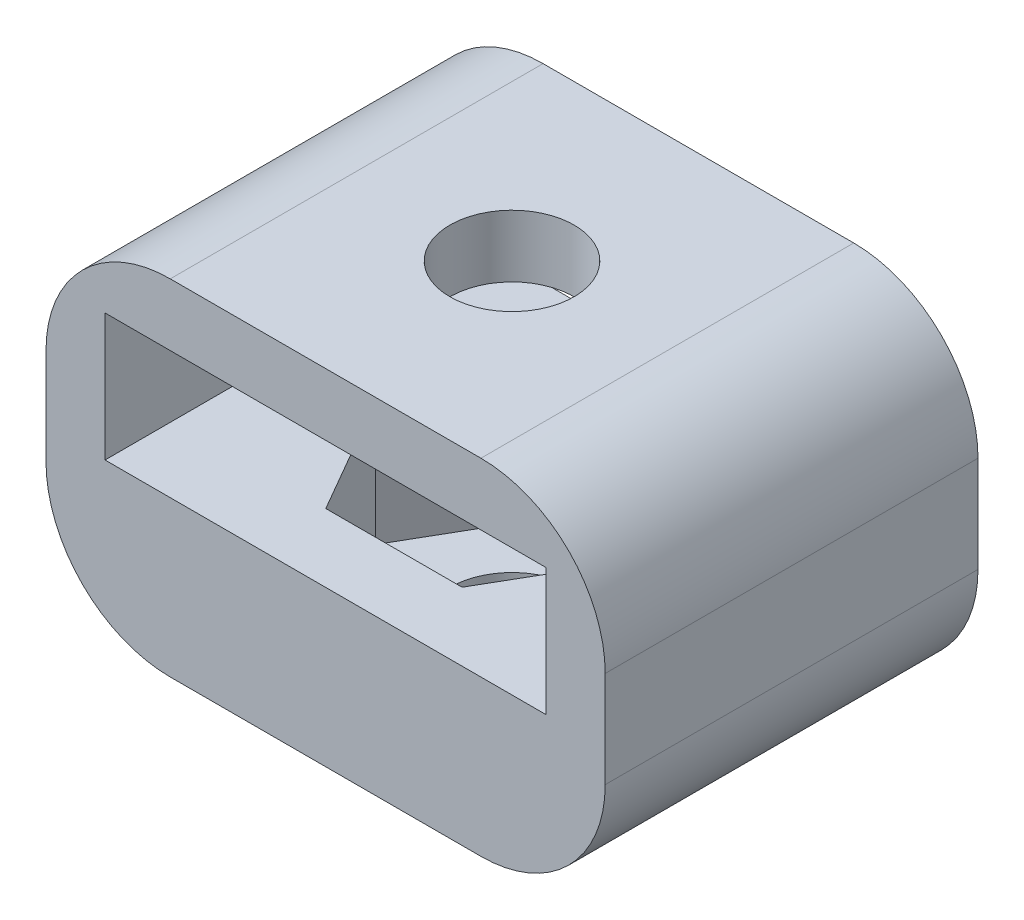
ISO-10303-21;
HEADER;
FILE_DESCRIPTION(('STEP AP214'),'2;1');
FILE_NAME('part.step','',(''),(''),'','','');
FILE_SCHEMA(('AUTOMOTIVE_DESIGN { 1 0 10303 214 1 1 1 1 }'));
ENDSEC;
DATA;
#1=APPLICATION_CONTEXT('core data for automotive mechanical design processes');
#2=APPLICATION_PROTOCOL_DEFINITION('international standard','automotive_design',2000,#1);
#3=PRODUCT_CONTEXT('',#1,'mechanical');
#4=PRODUCT('Part','Part','',(#3));
#5=PRODUCT_RELATED_PRODUCT_CATEGORY('part','',(#4));
#6=PRODUCT_DEFINITION_FORMATION('','',#4);
#7=PRODUCT_DEFINITION_CONTEXT('part definition',#1,'design');
#8=PRODUCT_DEFINITION('design','',#6,#7);
#9=PRODUCT_DEFINITION_SHAPE('','',#8);
#10=(LENGTH_UNIT() NAMED_UNIT(*) SI_UNIT(.MILLI.,.METRE.));
#11=(NAMED_UNIT(*) PLANE_ANGLE_UNIT() SI_UNIT($,.RADIAN.));
#12=(NAMED_UNIT(*) SI_UNIT($,.STERADIAN.) SOLID_ANGLE_UNIT());
#13=UNCERTAINTY_MEASURE_WITH_UNIT(LENGTH_MEASURE(1.E-05),#10,'distance_accuracy_value','');
#14=(GEOMETRIC_REPRESENTATION_CONTEXT(3) GLOBAL_UNCERTAINTY_ASSIGNED_CONTEXT((#13)) GLOBAL_UNIT_ASSIGNED_CONTEXT((#10,
#11,#12)) REPRESENTATION_CONTEXT('',''));
#15=CARTESIAN_POINT('',(0.,0.,0.));
#16=DIRECTION('',(0.,0.,1.));
#17=DIRECTION('',(1.,0.,0.));
#18=AXIS2_PLACEMENT_3D('',#15,#16,#17);
#19=CARTESIAN_POINT('',(0.,5.08,0.));
#20=DIRECTION('',(0.,1.,0.));
#21=DIRECTION('',(0.,0.,1.));
#22=AXIS2_PLACEMENT_3D('',#19,#20,#21);
#23=PLANE('',#22);
#24=DIRECTION('',(-0.500000000000001,0.,-0.866025403784438));
#25=VECTOR('',#24,1.);
#26=CARTESIAN_POINT('',(5.57258479821827,5.08,0.));
#27=LINE('',#26,#25);
#28=CARTESIAN_POINT('',(5.57258479821827,5.08,0.));
#29=VERTEX_POINT('',#28);
#30=CARTESIAN_POINT('',(2.78629239910912,5.08,-4.82600000000001));
#31=VERTEX_POINT('',#30);
#32=EDGE_CURVE('E195',#29,#31,#27,.T.);
#33=ORIENTED_EDGE('',*,*,#32,.F.);
#34=DIRECTION('',(0.499999999999995,0.,-0.866025403784441));
#35=VECTOR('',#34,1.);
#36=CARTESIAN_POINT('',(2.78629239910919,5.08,4.82599999999997));
#37=LINE('',#36,#35);
#38=CARTESIAN_POINT('',(2.78629239910919,5.08,4.82599999999997));
#39=VERTEX_POINT('',#38);
#40=EDGE_CURVE('E193',#39,#29,#37,.T.);
#41=ORIENTED_EDGE('',*,*,#40,.F.);
#42=DIRECTION('',(1.,0.,0.));
#43=VECTOR('',#42,1.);
#44=CARTESIAN_POINT('',(-2.78629239910909,5.08,4.82600000000003));
#45=LINE('',#44,#43);
#46=CARTESIAN_POINT('',(-2.78629239910909,5.08,4.82600000000003));
#47=VERTEX_POINT('',#46);
#48=EDGE_CURVE('E173',#47,#39,#45,.T.);
#49=ORIENTED_EDGE('',*,*,#48,.F.);
#50=DIRECTION('',(0.500000000000007,0.,0.866025403784435));
#51=VECTOR('',#50,1.);
#52=CARTESIAN_POINT('',(-5.57258479821827,5.08,0.));
#53=LINE('',#52,#51);
#54=CARTESIAN_POINT('',(-5.57258479821827,5.08,0.));
#55=VERTEX_POINT('',#54);
#56=EDGE_CURVE('E319',#55,#47,#53,.T.);
#57=ORIENTED_EDGE('',*,*,#56,.F.);
#58=DIRECTION('',(-0.499999999999995,0.,0.866025403784442));
#59=VECTOR('',#58,1.);
#60=CARTESIAN_POINT('',(-2.78629239910916,5.08,-4.82599999999999));
#61=LINE('',#60,#59);
#62=CARTESIAN_POINT('',(-2.78629239910916,5.08,-4.82599999999999));
#63=VERTEX_POINT('',#62);
#64=EDGE_CURVE('E317',#63,#55,#61,.T.);
#65=ORIENTED_EDGE('',*,*,#64,.F.);
#66=DIRECTION('',(-1.,0.,0.));
#67=VECTOR('',#66,1.);
#68=CARTESIAN_POINT('',(2.78629239910912,5.08,-4.82600000000001));
#69=LINE('',#68,#67);
#70=EDGE_CURVE('E315',#31,#63,#69,.T.);
#71=ORIENTED_EDGE('',*,*,#70,.F.);
#72=EDGE_LOOP('',(#33,#41,#49,#57,#65,#71));
#73=FACE_BOUND('',#72,.T.);
#74=DIRECTION('',(1.,0.,0.));
#75=VECTOR('',#74,1.);
#76=CARTESIAN_POINT('',(-11.43,5.08,7.62));
#77=LINE('',#76,#75);
#78=CARTESIAN_POINT('',(-9.017,5.08,7.62));
#79=VERTEX_POINT('',#78);
#80=CARTESIAN_POINT('',(9.017,5.08,7.62));
#81=VERTEX_POINT('',#80);
#82=EDGE_CURVE('E211',#79,#81,#77,.T.);
#83=ORIENTED_EDGE('',*,*,#82,.T.);
#84=DIRECTION('',(0.,0.,1.));
#85=VECTOR('',#84,1.);
#86=CARTESIAN_POINT('',(9.017,5.08,-7.62));
#87=LINE('',#86,#85);
#88=CARTESIAN_POINT('',(9.017,5.08,-7.62));
#89=VERTEX_POINT('',#88);
#90=EDGE_CURVE('E298',#89,#81,#87,.T.);
#91=ORIENTED_EDGE('',*,*,#90,.F.);
#92=DIRECTION('',(-1.,0.,0.));
#93=VECTOR('',#92,1.);
#94=CARTESIAN_POINT('',(-11.43,5.08,-7.62));
#95=LINE('',#94,#93);
#96=CARTESIAN_POINT('',(-9.017,5.08,-7.62));
#97=VERTEX_POINT('',#96);
#98=EDGE_CURVE('E209',#89,#97,#95,.T.);
#99=ORIENTED_EDGE('',*,*,#98,.T.);
#100=DIRECTION('',(0.,0.,-1.));
#101=VECTOR('',#100,1.);
#102=CARTESIAN_POINT('',(-9.017,5.08,-7.62));
#103=LINE('',#102,#101);
#104=EDGE_CURVE('E301',#79,#97,#103,.T.);
#105=ORIENTED_EDGE('',*,*,#104,.F.);
#106=EDGE_LOOP('',(#83,#91,#99,#105));
#107=FACE_BOUND('',#106,.T.);
#108=ADVANCED_FACE('F39',(#73,#107),#23,.T.);
#109=CARTESIAN_POINT('',(11.43,5.08,-7.62));
#110=DIRECTION('',(-1.,0.,0.));
#111=DIRECTION('',(0.,0.,1.));
#112=AXIS2_PLACEMENT_3D('',#109,#110,#111);
#113=PLANE('',#112);
#114=DIRECTION('',(0.,-1.,0.));
#115=VECTOR('',#114,1.);
#116=CARTESIAN_POINT('',(11.43,5.08,-7.62));
#117=LINE('',#116,#115);
#118=CARTESIAN_POINT('',(11.43,7.747,-7.62));
#119=VERTEX_POINT('',#118);
#120=CARTESIAN_POINT('',(11.43,3.81,-7.62));
#121=VERTEX_POINT('',#120);
#122=EDGE_CURVE('E221',#119,#121,#117,.T.);
#123=ORIENTED_EDGE('',*,*,#122,.F.);
#124=DIRECTION('',(0.,0.,-1.));
#125=VECTOR('',#124,1.);
#126=CARTESIAN_POINT('',(11.43,7.747,7.62));
#127=LINE('',#126,#125);
#128=CARTESIAN_POINT('',(11.43,7.747,7.62));
#129=VERTEX_POINT('',#128);
#130=EDGE_CURVE('E240',#119,#129,#127,.F.);
#131=ORIENTED_EDGE('',*,*,#130,.T.);
#132=DIRECTION('',(0.,-1.,0.));
#133=VECTOR('',#132,1.);
#134=CARTESIAN_POINT('',(11.43,5.08,7.62));
#135=LINE('',#134,#133);
#136=CARTESIAN_POINT('',(11.43,3.81,7.62));
#137=VERTEX_POINT('',#136);
#138=EDGE_CURVE('E213',#129,#137,#135,.T.);
#139=ORIENTED_EDGE('',*,*,#138,.T.);
#140=DIRECTION('',(0.,0.,1.));
#141=VECTOR('',#140,1.);
#142=CARTESIAN_POINT('',(11.43,3.81,-7.62));
#143=LINE('',#142,#141);
#144=EDGE_CURVE('E238',#137,#121,#143,.F.);
#145=ORIENTED_EDGE('',*,*,#144,.T.);
#146=EDGE_LOOP('',(#123,#131,#139,#145));
#147=FACE_BOUND('',#146,.T.);
#148=ADVANCED_FACE('F354',(#147),#113,.F.);
#149=CARTESIAN_POINT('',(-11.43,5.08,-7.62));
#150=DIRECTION('',(0.,0.,1.));
#151=DIRECTION('',(1.,0.,0.));
#152=AXIS2_PLACEMENT_3D('',#149,#150,#151);
#153=PLANE('',#152);
#154=DIRECTION('',(-1.,0.,0.));
#155=VECTOR('',#154,1.);
#156=CARTESIAN_POINT('',(-11.43,12.827,-7.62));
#157=LINE('',#156,#155);
#158=CARTESIAN_POINT('',(6.34999999999999,12.827,-7.62));
#159=VERTEX_POINT('',#158);
#160=CARTESIAN_POINT('',(-6.35,12.827,-7.62));
#161=VERTEX_POINT('',#160);
#162=EDGE_CURVE('E274',#159,#161,#157,.T.);
#163=ORIENTED_EDGE('',*,*,#162,.F.);
#164=CARTESIAN_POINT('',(6.35,7.747,-7.62));
#165=DIRECTION('',(0.,0.,1.));
#166=DIRECTION('',(1.,0.,0.));
#167=AXIS2_PLACEMENT_3D('',#164,#165,#166);
#168=CIRCLE('',#167,5.08);
#169=EDGE_CURVE('E236',#159,#119,#168,.F.);
#170=ORIENTED_EDGE('',*,*,#169,.T.);
#171=ORIENTED_EDGE('',*,*,#122,.T.);
#172=CARTESIAN_POINT('',(6.35,3.81,-7.62));
#173=DIRECTION('',(0.,0.,1.));
#174=DIRECTION('',(1.,0.,0.));
#175=AXIS2_PLACEMENT_3D('',#172,#173,#174);
#176=CIRCLE('',#175,5.08);
#177=CARTESIAN_POINT('',(6.35,-1.27,-7.62));
#178=VERTEX_POINT('',#177);
#179=EDGE_CURVE('E234',#121,#178,#176,.F.);
#180=ORIENTED_EDGE('',*,*,#179,.T.);
#181=DIRECTION('',(1.,0.,0.));
#182=VECTOR('',#181,1.);
#183=CARTESIAN_POINT('',(-11.43,-1.27,-7.62));
#184=LINE('',#183,#182);
#185=CARTESIAN_POINT('',(-6.35,-1.27,-7.62));
#186=VERTEX_POINT('',#185);
#187=EDGE_CURVE('E389',#186,#178,#184,.T.);
#188=ORIENTED_EDGE('',*,*,#187,.F.);
#189=CARTESIAN_POINT('',(-6.35,3.81,-7.62));
#190=DIRECTION('',(0.,0.,1.));
#191=DIRECTION('',(1.,0.,0.));
#192=AXIS2_PLACEMENT_3D('',#189,#190,#191);
#193=CIRCLE('',#192,5.08);
#194=CARTESIAN_POINT('',(-11.43,3.81,-7.62));
#195=VERTEX_POINT('',#194);
#196=EDGE_CURVE('E232',#186,#195,#193,.F.);
#197=ORIENTED_EDGE('',*,*,#196,.T.);
#198=DIRECTION('',(0.,-1.,0.));
#199=VECTOR('',#198,1.);
#200=CARTESIAN_POINT('',(-11.43,5.08,-7.62));
#201=LINE('',#200,#199);
#202=CARTESIAN_POINT('',(-11.43,7.747,-7.62));
#203=VERTEX_POINT('',#202);
#204=EDGE_CURVE('E218',#203,#195,#201,.T.);
#205=ORIENTED_EDGE('',*,*,#204,.F.);
#206=CARTESIAN_POINT('',(-6.35,7.747,-7.62));
#207=DIRECTION('',(0.,0.,1.));
#208=DIRECTION('',(1.,0.,0.));
#209=AXIS2_PLACEMENT_3D('',#206,#207,#208);
#210=CIRCLE('',#209,5.08);
#211=EDGE_CURVE('E230',#203,#161,#210,.F.);
#212=ORIENTED_EDGE('',*,*,#211,.T.);
#213=EDGE_LOOP('',(#163,#170,#171,#180,#188,#197,#205,#212));
#214=FACE_BOUND('',#213,.T.);
#215=DIRECTION('',(-1.,0.,0.));
#216=VECTOR('',#215,1.);
#217=CARTESIAN_POINT('',(-11.43,10.287,-7.62));
#218=LINE('',#217,#216);
#219=CARTESIAN_POINT('',(9.017,10.287,-7.62));
#220=VERTEX_POINT('',#219);
#221=CARTESIAN_POINT('',(-9.017,10.287,-7.62));
#222=VERTEX_POINT('',#221);
#223=EDGE_CURVE('E278',#220,#222,#218,.T.);
#224=ORIENTED_EDGE('',*,*,#223,.T.);
#225=DIRECTION('',(0.,-1.,0.));
#226=VECTOR('',#225,1.);
#227=CARTESIAN_POINT('',(-9.017,10.287,-7.62));
#228=LINE('',#227,#226);
#229=EDGE_CURVE('E307',#222,#97,#228,.T.);
#230=ORIENTED_EDGE('',*,*,#229,.T.);
#231=ORIENTED_EDGE('',*,*,#98,.F.);
#232=DIRECTION('',(0.,-1.,0.));
#233=VECTOR('',#232,1.);
#234=CARTESIAN_POINT('',(9.017,10.287,-7.62));
#235=LINE('',#234,#233);
#236=EDGE_CURVE('E280',#220,#89,#235,.T.);
#237=ORIENTED_EDGE('',*,*,#236,.F.);
#238=EDGE_LOOP('',(#224,#230,#231,#237));
#239=FACE_BOUND('',#238,.T.);
#240=ADVANCED_FACE('F262',(#214,#239),#153,.F.);
#241=CARTESIAN_POINT('',(-11.43,5.08,-7.62));
#242=DIRECTION('',(1.,0.,0.));
#243=DIRECTION('',(0.,0.,-1.));
#244=AXIS2_PLACEMENT_3D('',#241,#242,#243);
#245=PLANE('',#244);
#246=ORIENTED_EDGE('',*,*,#204,.T.);
#247=DIRECTION('',(0.,0.,-1.));
#248=VECTOR('',#247,1.);
#249=CARTESIAN_POINT('',(-11.43,3.81,7.62));
#250=LINE('',#249,#248);
#251=CARTESIAN_POINT('',(-11.43,3.81,7.62));
#252=VERTEX_POINT('',#251);
#253=EDGE_CURVE('E11',#195,#252,#250,.F.);
#254=ORIENTED_EDGE('',*,*,#253,.T.);
#255=DIRECTION('',(0.,-1.,0.));
#256=VECTOR('',#255,1.);
#257=CARTESIAN_POINT('',(-11.43,5.08,7.62));
#258=LINE('',#257,#256);
#259=CARTESIAN_POINT('',(-11.43,7.747,7.62));
#260=VERTEX_POINT('',#259);
#261=EDGE_CURVE('E216',#260,#252,#258,.T.);
#262=ORIENTED_EDGE('',*,*,#261,.F.);
#263=DIRECTION('',(0.,0.,1.));
#264=VECTOR('',#263,1.);
#265=CARTESIAN_POINT('',(-11.43,7.747,-7.62));
#266=LINE('',#265,#264);
#267=EDGE_CURVE('E47',#260,#203,#266,.F.);
#268=ORIENTED_EDGE('',*,*,#267,.T.);
#269=EDGE_LOOP('',(#246,#254,#262,#268));
#270=FACE_BOUND('',#269,.T.);
#271=ADVANCED_FACE('F256',(#270),#245,.F.);
#272=CARTESIAN_POINT('',(-11.43,5.08,7.62));
#273=DIRECTION('',(0.,0.,-1.));
#274=DIRECTION('',(-1.,0.,0.));
#275=AXIS2_PLACEMENT_3D('',#272,#273,#274);
#276=PLANE('',#275);
#277=DIRECTION('',(0.,-1.,0.));
#278=VECTOR('',#277,1.);
#279=CARTESIAN_POINT('',(-9.017,10.287,7.62));
#280=LINE('',#279,#278);
#281=CARTESIAN_POINT('',(-9.017,10.287,7.62));
#282=VERTEX_POINT('',#281);
#283=EDGE_CURVE('E187',#282,#79,#280,.T.);
#284=ORIENTED_EDGE('',*,*,#283,.F.);
#285=DIRECTION('',(1.,0.,0.));
#286=VECTOR('',#285,1.);
#287=CARTESIAN_POINT('',(-11.43,10.287,7.62));
#288=LINE('',#287,#286);
#289=CARTESIAN_POINT('',(9.017,10.287,7.62));
#290=VERTEX_POINT('',#289);
#291=EDGE_CURVE('E283',#282,#290,#288,.T.);
#292=ORIENTED_EDGE('',*,*,#291,.T.);
#293=DIRECTION('',(0.,-1.,0.));
#294=VECTOR('',#293,1.);
#295=CARTESIAN_POINT('',(9.017,10.287,7.62));
#296=LINE('',#295,#294);
#297=EDGE_CURVE('E294',#290,#81,#296,.T.);
#298=ORIENTED_EDGE('',*,*,#297,.T.);
#299=ORIENTED_EDGE('',*,*,#82,.F.);
#300=EDGE_LOOP('',(#284,#292,#298,#299));
#301=FACE_BOUND('',#300,.T.);
#302=ORIENTED_EDGE('',*,*,#138,.F.);
#303=CARTESIAN_POINT('',(6.35,7.747,7.62));
#304=DIRECTION('',(0.,0.,-1.));
#305=DIRECTION('',(-1.,0.,0.));
#306=AXIS2_PLACEMENT_3D('',#303,#304,#305);
#307=CIRCLE('',#306,5.08);
#308=CARTESIAN_POINT('',(6.35,12.827,7.62));
#309=VERTEX_POINT('',#308);
#310=EDGE_CURVE('E246',#129,#309,#307,.F.);
#311=ORIENTED_EDGE('',*,*,#310,.T.);
#312=DIRECTION('',(1.,0.,0.));
#313=VECTOR('',#312,1.);
#314=CARTESIAN_POINT('',(-11.43,12.827,7.62));
#315=LINE('',#314,#313);
#316=CARTESIAN_POINT('',(-6.35,12.827,7.62));
#317=VERTEX_POINT('',#316);
#318=EDGE_CURVE('E272',#317,#309,#315,.T.);
#319=ORIENTED_EDGE('',*,*,#318,.F.);
#320=CARTESIAN_POINT('',(-6.35,7.747,7.62));
#321=DIRECTION('',(0.,0.,-1.));
#322=DIRECTION('',(-1.,0.,0.));
#323=AXIS2_PLACEMENT_3D('',#320,#321,#322);
#324=CIRCLE('',#323,5.08);
#325=EDGE_CURVE('E242',#317,#260,#324,.F.);
#326=ORIENTED_EDGE('',*,*,#325,.T.);
#327=ORIENTED_EDGE('',*,*,#261,.T.);
#328=CARTESIAN_POINT('',(-6.35,3.81,7.62));
#329=DIRECTION('',(0.,0.,-1.));
#330=DIRECTION('',(-1.,0.,0.));
#331=AXIS2_PLACEMENT_3D('',#328,#329,#330);
#332=CIRCLE('',#331,5.08);
#333=CARTESIAN_POINT('',(-6.35,-1.27,7.62));
#334=VERTEX_POINT('',#333);
#335=EDGE_CURVE('E54',#252,#334,#332,.F.);
#336=ORIENTED_EDGE('',*,*,#335,.T.);
#337=DIRECTION('',(-1.,0.,0.));
#338=VECTOR('',#337,1.);
#339=CARTESIAN_POINT('',(-11.43,-1.27,7.62));
#340=LINE('',#339,#338);
#341=CARTESIAN_POINT('',(6.35,-1.27,7.62));
#342=VERTEX_POINT('',#341);
#343=EDGE_CURVE('E390',#342,#334,#340,.T.);
#344=ORIENTED_EDGE('',*,*,#343,.F.);
#345=CARTESIAN_POINT('',(6.35,3.81,7.62));
#346=DIRECTION('',(0.,0.,-1.));
#347=DIRECTION('',(-1.,0.,0.));
#348=AXIS2_PLACEMENT_3D('',#345,#346,#347);
#349=CIRCLE('',#348,5.08);
#350=EDGE_CURVE('E62',#342,#137,#349,.F.);
#351=ORIENTED_EDGE('',*,*,#350,.T.);
#352=EDGE_LOOP('',(#302,#311,#319,#326,#327,#336,#344,#351));
#353=FACE_BOUND('',#352,.T.);
#354=ADVANCED_FACE('F276',(#301,#353),#276,.F.);
#355=CARTESIAN_POINT('',(2.78629239910919,5.08,4.82599999999997));
#356=DIRECTION('',(-0.866025403784441,0.,-0.499999999999995));
#357=DIRECTION('',(-0.499999999999995,0.,0.866025403784442));
#358=AXIS2_PLACEMENT_3D('',#355,#356,#357);
#359=PLANE('',#358);
#360=DIRECTION('',(0.499999999999995,0.,-0.866025403784441));
#361=VECTOR('',#360,1.);
#362=CARTESIAN_POINT('',(2.78629239910919,0.,4.82599999999997));
#363=LINE('',#362,#361);
#364=CARTESIAN_POINT('',(2.78629239910919,0.,4.82599999999997));
#365=VERTEX_POINT('',#364);
#366=CARTESIAN_POINT('',(5.57258479821827,0.,0.));
#367=VERTEX_POINT('',#366);
#368=EDGE_CURVE('E180',#365,#367,#363,.T.);
#369=ORIENTED_EDGE('',*,*,#368,.F.);
#370=DIRECTION('',(0.,-1.,0.));
#371=VECTOR('',#370,1.);
#372=CARTESIAN_POINT('',(2.78629239910919,5.08,4.82599999999997));
#373=LINE('',#372,#371);
#374=EDGE_CURVE('E166',#39,#365,#373,.T.);
#375=ORIENTED_EDGE('',*,*,#374,.F.);
#376=ORIENTED_EDGE('',*,*,#40,.T.);
#377=DIRECTION('',(0.,-1.,0.));
#378=VECTOR('',#377,1.);
#379=CARTESIAN_POINT('',(5.57258479821827,5.08,0.));
#380=LINE('',#379,#378);
#381=EDGE_CURVE('E183',#29,#367,#380,.T.);
#382=ORIENTED_EDGE('',*,*,#381,.T.);
#383=EDGE_LOOP('',(#369,#375,#376,#382));
#384=FACE_BOUND('',#383,.T.);
#385=ADVANCED_FACE('F181',(#384),#359,.T.);
#386=CARTESIAN_POINT('',(5.57258479821827,5.08,0.));
#387=DIRECTION('',(-0.866025403784438,0.,0.500000000000001));
#388=DIRECTION('',(0.500000000000001,0.,0.866025403784438));
#389=AXIS2_PLACEMENT_3D('',#386,#387,#388);
#390=PLANE('',#389);
#391=DIRECTION('',(-0.500000000000001,0.,-0.866025403784438));
#392=VECTOR('',#391,1.);
#393=CARTESIAN_POINT('',(5.57258479821827,0.,0.));
#394=LINE('',#393,#392);
#395=CARTESIAN_POINT('',(2.78629239910912,0.,-4.82600000000001));
#396=VERTEX_POINT('',#395);
#397=EDGE_CURVE('E186',#367,#396,#394,.T.);
#398=ORIENTED_EDGE('',*,*,#397,.F.);
#399=ORIENTED_EDGE('',*,*,#381,.F.);
#400=ORIENTED_EDGE('',*,*,#32,.T.);
#401=DIRECTION('',(0.,-1.,0.));
#402=VECTOR('',#401,1.);
#403=CARTESIAN_POINT('',(2.78629239910912,5.08,-4.82600000000001));
#404=LINE('',#403,#402);
#405=EDGE_CURVE('E206',#31,#396,#404,.T.);
#406=ORIENTED_EDGE('',*,*,#405,.T.);
#407=EDGE_LOOP('',(#398,#399,#400,#406));
#408=FACE_BOUND('',#407,.T.);
#409=ADVANCED_FACE('F341',(#408),#390,.T.);
#410=CARTESIAN_POINT('',(2.78629239910912,5.08,-4.82600000000001));
#411=DIRECTION('',(0.,0.,1.));
#412=DIRECTION('',(1.,0.,0.));
#413=AXIS2_PLACEMENT_3D('',#410,#411,#412);
#414=PLANE('',#413);
#415=DIRECTION('',(-1.,0.,0.));
#416=VECTOR('',#415,1.);
#417=CARTESIAN_POINT('',(2.78629239910912,0.,-4.82600000000001));
#418=LINE('',#417,#416);
#419=CARTESIAN_POINT('',(-2.78629239910916,0.,-4.82599999999999));
#420=VERTEX_POINT('',#419);
#421=EDGE_CURVE('E324',#396,#420,#418,.T.);
#422=ORIENTED_EDGE('',*,*,#421,.F.);
#423=ORIENTED_EDGE('',*,*,#405,.F.);
#424=ORIENTED_EDGE('',*,*,#70,.T.);
#425=DIRECTION('',(0.,-1.,0.));
#426=VECTOR('',#425,1.);
#427=CARTESIAN_POINT('',(-2.78629239910916,5.08,-4.82599999999999));
#428=LINE('',#427,#426);
#429=EDGE_CURVE('E204',#63,#420,#428,.T.);
#430=ORIENTED_EDGE('',*,*,#429,.T.);
#431=EDGE_LOOP('',(#422,#423,#424,#430));
#432=FACE_BOUND('',#431,.T.);
#433=ADVANCED_FACE('F344',(#432),#414,.T.);
#434=CARTESIAN_POINT('',(-2.78629239910916,5.08,-4.82599999999999));
#435=DIRECTION('',(0.866025403784442,0.,0.499999999999995));
#436=DIRECTION('',(0.499999999999995,0.,-0.866025403784442));
#437=AXIS2_PLACEMENT_3D('',#434,#435,#436);
#438=PLANE('',#437);
#439=DIRECTION('',(-0.499999999999995,0.,0.866025403784442));
#440=VECTOR('',#439,1.);
#441=CARTESIAN_POINT('',(-2.78629239910916,0.,-4.82599999999999));
#442=LINE('',#441,#440);
#443=CARTESIAN_POINT('',(-5.57258479821827,0.,0.));
#444=VERTEX_POINT('',#443);
#445=EDGE_CURVE('E197',#420,#444,#442,.T.);
#446=ORIENTED_EDGE('',*,*,#445,.F.);
#447=ORIENTED_EDGE('',*,*,#429,.F.);
#448=ORIENTED_EDGE('',*,*,#64,.T.);
#449=DIRECTION('',(0.,-1.,0.));
#450=VECTOR('',#449,1.);
#451=CARTESIAN_POINT('',(-5.57258479821827,5.08,0.));
#452=LINE('',#451,#450);
#453=EDGE_CURVE('E202',#55,#444,#452,.T.);
#454=ORIENTED_EDGE('',*,*,#453,.T.);
#455=EDGE_LOOP('',(#446,#447,#448,#454));
#456=FACE_BOUND('',#455,.T.);
#457=ADVANCED_FACE('F330',(#456),#438,.T.);
#458=CARTESIAN_POINT('',(-5.57258479821827,5.08,0.));
#459=DIRECTION('',(0.866025403784434,0.,-0.500000000000007));
#460=DIRECTION('',(-0.500000000000007,0.,-0.866025403784435));
#461=AXIS2_PLACEMENT_3D('',#458,#459,#460);
#462=PLANE('',#461);
#463=DIRECTION('',(0.500000000000007,0.,0.866025403784435));
#464=VECTOR('',#463,1.);
#465=CARTESIAN_POINT('',(-5.57258479821827,0.,0.));
#466=LINE('',#465,#464);
#467=CARTESIAN_POINT('',(-2.78629239910909,0.,4.82600000000003));
#468=VERTEX_POINT('',#467);
#469=EDGE_CURVE('E192',#444,#468,#466,.T.);
#470=ORIENTED_EDGE('',*,*,#469,.F.);
#471=ORIENTED_EDGE('',*,*,#453,.F.);
#472=ORIENTED_EDGE('',*,*,#56,.T.);
#473=DIRECTION('',(0.,-1.,0.));
#474=VECTOR('',#473,1.);
#475=CARTESIAN_POINT('',(-2.78629239910909,5.08,4.82600000000003));
#476=LINE('',#475,#474);
#477=EDGE_CURVE('E176',#47,#468,#476,.T.);
#478=ORIENTED_EDGE('',*,*,#477,.T.);
#479=EDGE_LOOP('',(#470,#471,#472,#478));
#480=FACE_BOUND('',#479,.T.);
#481=ADVANCED_FACE('F335',(#480),#462,.T.);
#482=CARTESIAN_POINT('',(-2.78629239910909,5.08,4.82600000000003));
#483=DIRECTION('',(0.,0.,-1.));
#484=DIRECTION('',(-1.,0.,0.));
#485=AXIS2_PLACEMENT_3D('',#482,#483,#484);
#486=PLANE('',#485);
#487=DIRECTION('',(1.,0.,0.));
#488=VECTOR('',#487,1.);
#489=CARTESIAN_POINT('',(-2.78629239910909,0.,4.82600000000003));
#490=LINE('',#489,#488);
#491=EDGE_CURVE('E170',#468,#365,#490,.T.);
#492=ORIENTED_EDGE('',*,*,#491,.F.);
#493=ORIENTED_EDGE('',*,*,#477,.F.);
#494=ORIENTED_EDGE('',*,*,#48,.T.);
#495=ORIENTED_EDGE('',*,*,#374,.T.);
#496=EDGE_LOOP('',(#492,#493,#494,#495));
#497=FACE_BOUND('',#496,.T.);
#498=ADVANCED_FACE('F168',(#497),#486,.T.);
#499=CARTESIAN_POINT('',(-9.017,10.287,-7.62));
#500=DIRECTION('',(-1.,0.,0.));
#501=DIRECTION('',(0.,0.,1.));
#502=AXIS2_PLACEMENT_3D('',#499,#500,#501);
#503=PLANE('',#502);
#504=ORIENTED_EDGE('',*,*,#104,.T.);
#505=ORIENTED_EDGE('',*,*,#229,.F.);
#506=DIRECTION('',(0.,0.,-1.));
#507=VECTOR('',#506,1.);
#508=CARTESIAN_POINT('',(-9.017,10.287,-7.62));
#509=LINE('',#508,#507);
#510=EDGE_CURVE('E304',#282,#222,#509,.T.);
#511=ORIENTED_EDGE('',*,*,#510,.F.);
#512=ORIENTED_EDGE('',*,*,#283,.T.);
#513=EDGE_LOOP('',(#504,#505,#511,#512));
#514=FACE_BOUND('',#513,.T.);
#515=ADVANCED_FACE('F426',(#514),#503,.F.);
#516=CARTESIAN_POINT('',(9.017,10.287,-7.62));
#517=DIRECTION('',(1.,0.,0.));
#518=DIRECTION('',(0.,0.,-1.));
#519=AXIS2_PLACEMENT_3D('',#516,#517,#518);
#520=PLANE('',#519);
#521=ORIENTED_EDGE('',*,*,#90,.T.);
#522=ORIENTED_EDGE('',*,*,#297,.F.);
#523=DIRECTION('',(0.,0.,1.));
#524=VECTOR('',#523,1.);
#525=CARTESIAN_POINT('',(9.017,10.287,-7.62));
#526=LINE('',#525,#524);
#527=EDGE_CURVE('E297',#220,#290,#526,.T.);
#528=ORIENTED_EDGE('',*,*,#527,.F.);
#529=ORIENTED_EDGE('',*,*,#236,.T.);
#530=EDGE_LOOP('',(#521,#522,#528,#529));
#531=FACE_BOUND('',#530,.T.);
#532=ADVANCED_FACE('F423',(#531),#520,.F.);
#533=CARTESIAN_POINT('',(0.,10.287,0.));
#534=DIRECTION('',(0.,1.,0.));
#535=DIRECTION('',(0.,0.,1.));
#536=AXIS2_PLACEMENT_3D('',#533,#534,#535);
#537=PLANE('',#536);
#538=CARTESIAN_POINT('',(0.,10.287,0.));
#539=DIRECTION('',(0.,1.,0.));
#540=DIRECTION('',(0.,0.,1.));
#541=AXIS2_PLACEMENT_3D('',#538,#539,#540);
#542=CIRCLE('',#541,2.54);
#543=CARTESIAN_POINT('',(0.,10.287,2.54));
#544=VERTEX_POINT('',#543);
#545=EDGE_CURVE('E286',#544,#544,#542,.T.);
#546=ORIENTED_EDGE('',*,*,#545,.T.);
#547=EDGE_LOOP('',(#546));
#548=FACE_BOUND('',#547,.T.);
#549=ORIENTED_EDGE('',*,*,#291,.F.);
#550=ORIENTED_EDGE('',*,*,#510,.T.);
#551=ORIENTED_EDGE('',*,*,#223,.F.);
#552=ORIENTED_EDGE('',*,*,#527,.T.);
#553=EDGE_LOOP('',(#549,#550,#551,#552));
#554=FACE_BOUND('',#553,.T.);
#555=ADVANCED_FACE('F405',(#548,#554),#537,.F.);
#556=CARTESIAN_POINT('',(0.,12.827,0.));
#557=DIRECTION('',(0.,1.,0.));
#558=DIRECTION('',(0.,0.,1.));
#559=AXIS2_PLACEMENT_3D('',#556,#557,#558);
#560=PLANE('',#559);
#561=ORIENTED_EDGE('',*,*,#318,.T.);
#562=DIRECTION('',(0.,0.,-1.));
#563=VECTOR('',#562,1.);
#564=CARTESIAN_POINT('',(6.35,12.827,-7.62));
#565=LINE('',#564,#563);
#566=EDGE_CURVE('E227',#309,#159,#565,.T.);
#567=ORIENTED_EDGE('',*,*,#566,.T.);
#568=ORIENTED_EDGE('',*,*,#162,.T.);
#569=DIRECTION('',(0.,0.,1.));
#570=VECTOR('',#569,1.);
#571=CARTESIAN_POINT('',(-6.35,12.827,7.62));
#572=LINE('',#571,#570);
#573=EDGE_CURVE('E224',#161,#317,#572,.T.);
#574=ORIENTED_EDGE('',*,*,#573,.T.);
#575=EDGE_LOOP('',(#561,#567,#568,#574));
#576=FACE_BOUND('',#575,.T.);
#577=CARTESIAN_POINT('',(0.,12.827,0.));
#578=DIRECTION('',(0.,1.,0.));
#579=DIRECTION('',(0.,0.,1.));
#580=AXIS2_PLACEMENT_3D('',#577,#578,#579);
#581=CIRCLE('',#580,2.54);
#582=CARTESIAN_POINT('',(0.,12.827,2.54));
#583=VERTEX_POINT('',#582);
#584=EDGE_CURVE('E290',#583,#583,#581,.T.);
#585=ORIENTED_EDGE('',*,*,#584,.F.);
#586=EDGE_LOOP('',(#585));
#587=FACE_BOUND('',#586,.T.);
#588=ADVANCED_FACE('F270',(#576,#587),#560,.T.);
#589=CARTESIAN_POINT('',(0.,12.827,0.));
#590=DIRECTION('',(0.,-1.,0.));
#591=DIRECTION('',(0.,0.,-1.));
#592=AXIS2_PLACEMENT_3D('',#589,#590,#591);
#593=CYLINDRICAL_SURFACE('',#592,2.54);
#594=ORIENTED_EDGE('',*,*,#584,.T.);
#595=EDGE_LOOP('',(#594));
#596=FACE_BOUND('',#595,.T.);
#597=ORIENTED_EDGE('',*,*,#545,.F.);
#598=EDGE_LOOP('',(#597));
#599=FACE_BOUND('',#598,.T.);
#600=ADVANCED_FACE('F408',(#596,#599),#593,.F.);
#601=CARTESIAN_POINT('',(0.,0.,0.));
#602=DIRECTION('',(0.,-1.,0.));
#603=DIRECTION('',(0.,0.,-1.));
#604=AXIS2_PLACEMENT_3D('',#601,#602,#603);
#605=PLANE('',#604);
#606=CARTESIAN_POINT('',(0.,0.,0.));
#607=DIRECTION('',(0.,-1.,0.));
#608=DIRECTION('',(0.,0.,-1.));
#609=AXIS2_PLACEMENT_3D('',#606,#607,#608);
#610=CIRCLE('',#609,2.54);
#611=CARTESIAN_POINT('',(0.,0.,-2.54));
#612=VERTEX_POINT('',#611);
#613=EDGE_CURVE('E396',#612,#612,#610,.T.);
#614=ORIENTED_EDGE('',*,*,#613,.T.);
#615=EDGE_LOOP('',(#614));
#616=FACE_BOUND('',#615,.T.);
#617=ORIENTED_EDGE('',*,*,#491,.T.);
#618=ORIENTED_EDGE('',*,*,#368,.T.);
#619=ORIENTED_EDGE('',*,*,#397,.T.);
#620=ORIENTED_EDGE('',*,*,#421,.T.);
#621=ORIENTED_EDGE('',*,*,#445,.T.);
#622=ORIENTED_EDGE('',*,*,#469,.T.);
#623=EDGE_LOOP('',(#617,#618,#619,#620,#621,#622));
#624=FACE_BOUND('',#623,.T.);
#625=ADVANCED_FACE('F189',(#616,#624),#605,.F.);
#626=CARTESIAN_POINT('',(0.,-1.27,0.));
#627=DIRECTION('',(0.,-1.,0.));
#628=DIRECTION('',(0.,0.,-1.));
#629=AXIS2_PLACEMENT_3D('',#626,#627,#628);
#630=PLANE('',#629);
#631=ORIENTED_EDGE('',*,*,#187,.T.);
#632=DIRECTION('',(0.,0.,1.));
#633=VECTOR('',#632,1.);
#634=CARTESIAN_POINT('',(6.35,-1.27,7.62));
#635=LINE('',#634,#633);
#636=EDGE_CURVE('E251',#178,#342,#635,.T.);
#637=ORIENTED_EDGE('',*,*,#636,.T.);
#638=ORIENTED_EDGE('',*,*,#343,.T.);
#639=DIRECTION('',(0.,0.,-1.));
#640=VECTOR('',#639,1.);
#641=CARTESIAN_POINT('',(-6.35,-1.27,-7.62));
#642=LINE('',#641,#640);
#643=EDGE_CURVE('E248',#334,#186,#642,.T.);
#644=ORIENTED_EDGE('',*,*,#643,.T.);
#645=EDGE_LOOP('',(#631,#637,#638,#644));
#646=FACE_BOUND('',#645,.T.);
#647=CARTESIAN_POINT('',(0.,-1.27,0.));
#648=DIRECTION('',(0.,-1.,0.));
#649=DIRECTION('',(0.,0.,-1.));
#650=AXIS2_PLACEMENT_3D('',#647,#648,#649);
#651=CIRCLE('',#650,2.54);
#652=CARTESIAN_POINT('',(0.,-1.27,-2.54));
#653=VERTEX_POINT('',#652);
#654=EDGE_CURVE('E392',#653,#653,#651,.T.);
#655=ORIENTED_EDGE('',*,*,#654,.F.);
#656=EDGE_LOOP('',(#655));
#657=FACE_BOUND('',#656,.T.);
#658=ADVANCED_FACE('F387',(#646,#657),#630,.T.);
#659=CARTESIAN_POINT('',(0.,-1.27,0.));
#660=DIRECTION('',(0.,1.,0.));
#661=DIRECTION('',(0.,0.,1.));
#662=AXIS2_PLACEMENT_3D('',#659,#660,#661);
#663=CYLINDRICAL_SURFACE('',#662,2.54);
#664=ORIENTED_EDGE('',*,*,#654,.T.);
#665=EDGE_LOOP('',(#664));
#666=FACE_BOUND('',#665,.T.);
#667=ORIENTED_EDGE('',*,*,#613,.F.);
#668=EDGE_LOOP('',(#667));
#669=FACE_BOUND('',#668,.T.);
#670=ADVANCED_FACE('F375',(#666,#669),#663,.F.);
#671=CARTESIAN_POINT('',(6.35,7.747,0.));
#672=DIRECTION('',(0.,0.,1.));
#673=DIRECTION('',(1.,0.,0.));
#674=AXIS2_PLACEMENT_3D('',#671,#672,#673);
#675=CYLINDRICAL_SURFACE('',#674,5.08);
#676=ORIENTED_EDGE('',*,*,#310,.F.);
#677=ORIENTED_EDGE('',*,*,#130,.F.);
#678=ORIENTED_EDGE('',*,*,#169,.F.);
#679=ORIENTED_EDGE('',*,*,#566,.F.);
#680=EDGE_LOOP('',(#676,#677,#678,#679));
#681=FACE_BOUND('',#680,.T.);
#682=ADVANCED_FACE('F371',(#681),#675,.T.);
#683=CARTESIAN_POINT('',(6.35,3.81,0.));
#684=DIRECTION('',(0.,0.,-1.));
#685=DIRECTION('',(-1.,0.,0.));
#686=AXIS2_PLACEMENT_3D('',#683,#684,#685);
#687=CYLINDRICAL_SURFACE('',#686,5.08);
#688=ORIENTED_EDGE('',*,*,#179,.F.);
#689=ORIENTED_EDGE('',*,*,#144,.F.);
#690=ORIENTED_EDGE('',*,*,#350,.F.);
#691=ORIENTED_EDGE('',*,*,#636,.F.);
#692=EDGE_LOOP('',(#688,#689,#690,#691));
#693=FACE_BOUND('',#692,.T.);
#694=ADVANCED_FACE('F374',(#693),#687,.T.);
#695=CARTESIAN_POINT('',(-6.35,3.81,0.));
#696=DIRECTION('',(0.,0.,1.));
#697=DIRECTION('',(1.,0.,0.));
#698=AXIS2_PLACEMENT_3D('',#695,#696,#697);
#699=CYLINDRICAL_SURFACE('',#698,5.08);
#700=ORIENTED_EDGE('',*,*,#335,.F.);
#701=ORIENTED_EDGE('',*,*,#253,.F.);
#702=ORIENTED_EDGE('',*,*,#196,.F.);
#703=ORIENTED_EDGE('',*,*,#643,.F.);
#704=EDGE_LOOP('',(#700,#701,#702,#703));
#705=FACE_BOUND('',#704,.T.);
#706=ADVANCED_FACE('F378',(#705),#699,.T.);
#707=CARTESIAN_POINT('',(-6.35,7.747,0.));
#708=DIRECTION('',(0.,0.,-1.));
#709=DIRECTION('',(-1.,0.,0.));
#710=AXIS2_PLACEMENT_3D('',#707,#708,#709);
#711=CYLINDRICAL_SURFACE('',#710,5.08);
#712=ORIENTED_EDGE('',*,*,#211,.F.);
#713=ORIENTED_EDGE('',*,*,#267,.F.);
#714=ORIENTED_EDGE('',*,*,#325,.F.);
#715=ORIENTED_EDGE('',*,*,#573,.F.);
#716=EDGE_LOOP('',(#712,#713,#714,#715));
#717=FACE_BOUND('',#716,.T.);
#718=ADVANCED_FACE('F41',(#717),#711,.T.);
#719=CLOSED_SHELL('',(#108,#148,#240,#271,#354,#385,#409,#433,#457,#481,#498,#515,#532,#555,
#588,#600,#625,#658,#670,#682,#694,#706,#718));
#720=MANIFOLD_SOLID_BREP('B2',#719);
#721=ADVANCED_BREP_SHAPE_REPRESENTATION('',(#18,#720),#14);
#722=SHAPE_DEFINITION_REPRESENTATION(#9,#721);
ENDSEC;
END-ISO-10303-21;
